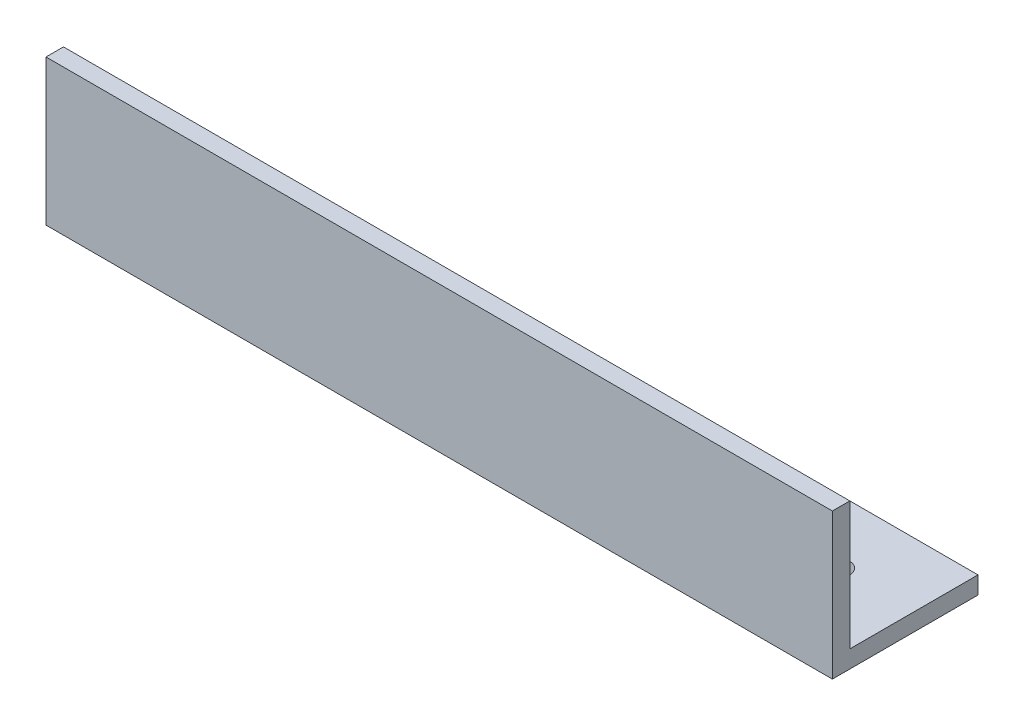
ISO-10303-21;
HEADER;
FILE_DESCRIPTION(('STEP AP214'),'2;1');
FILE_NAME('part.step','',(''),(''),'','','');
FILE_SCHEMA(('AUTOMOTIVE_DESIGN { 1 0 10303 214 1 1 1 1 }'));
ENDSEC;
DATA;
#1=APPLICATION_CONTEXT('core data for automotive mechanical design processes');
#2=APPLICATION_PROTOCOL_DEFINITION('international standard','automotive_design',2000,#1);
#3=PRODUCT_CONTEXT('',#1,'mechanical');
#4=PRODUCT('Part','Part','',(#3));
#5=PRODUCT_RELATED_PRODUCT_CATEGORY('part','',(#4));
#6=PRODUCT_DEFINITION_FORMATION('','',#4);
#7=PRODUCT_DEFINITION_CONTEXT('part definition',#1,'design');
#8=PRODUCT_DEFINITION('design','',#6,#7);
#9=PRODUCT_DEFINITION_SHAPE('','',#8);
#10=(LENGTH_UNIT() NAMED_UNIT(*) SI_UNIT(.MILLI.,.METRE.));
#11=(NAMED_UNIT(*) PLANE_ANGLE_UNIT() SI_UNIT($,.RADIAN.));
#12=(NAMED_UNIT(*) SI_UNIT($,.STERADIAN.) SOLID_ANGLE_UNIT());
#13=UNCERTAINTY_MEASURE_WITH_UNIT(LENGTH_MEASURE(1.E-05),#10,'distance_accuracy_value','');
#14=(GEOMETRIC_REPRESENTATION_CONTEXT(3) GLOBAL_UNCERTAINTY_ASSIGNED_CONTEXT((#13)) GLOBAL_UNIT_ASSIGNED_CONTEXT((#10,
#11,#12)) REPRESENTATION_CONTEXT('',''));
#15=CARTESIAN_POINT('',(0.,0.,0.));
#16=DIRECTION('',(0.,0.,1.));
#17=DIRECTION('',(1.,0.,0.));
#18=AXIS2_PLACEMENT_3D('',#15,#16,#17);
#19=CARTESIAN_POINT('',(270.,0.,0.));
#20=DIRECTION('',(0.,1.,0.));
#21=DIRECTION('',(0.,0.,1.));
#22=AXIS2_PLACEMENT_3D('',#19,#20,#21);
#23=PLANE('',#22);
#24=CARTESIAN_POINT('',(244.,0.,-28.));
#25=DIRECTION('',(0.,-1.,0.));
#26=DIRECTION('',(0.,0.,1.));
#27=AXIS2_PLACEMENT_3D('',#24,#25,#26);
#28=CIRCLE('',#27,3.99999999999999);
#29=CARTESIAN_POINT('',(244.,0.,-24.));
#30=VERTEX_POINT('',#29);
#31=EDGE_CURVE('E143',#30,#30,#28,.T.);
#32=ORIENTED_EDGE('',*,*,#31,.F.);
#33=EDGE_LOOP('',(#32));
#34=FACE_BOUND('',#33,.T.);
#35=CARTESIAN_POINT('',(26.,0.,-28.));
#36=DIRECTION('',(0.,-1.,0.));
#37=DIRECTION('',(0.,0.,-1.));
#38=AXIS2_PLACEMENT_3D('',#35,#36,#37);
#39=CIRCLE('',#38,4.);
#40=CARTESIAN_POINT('',(26.,0.,-32.));
#41=VERTEX_POINT('',#40);
#42=EDGE_CURVE('E135',#41,#41,#39,.T.);
#43=ORIENTED_EDGE('',*,*,#42,.F.);
#44=EDGE_LOOP('',(#43));
#45=FACE_BOUND('',#44,.T.);
#46=DIRECTION('',(0.,0.,-1.));
#47=VECTOR('',#46,1.);
#48=CARTESIAN_POINT('',(0.,0.,0.));
#49=LINE('',#48,#47);
#50=CARTESIAN_POINT('',(0.,0.,0.));
#51=VERTEX_POINT('',#50);
#52=CARTESIAN_POINT('',(0.,0.,-50.));
#53=VERTEX_POINT('',#52);
#54=EDGE_CURVE('E117',#51,#53,#49,.T.);
#55=ORIENTED_EDGE('',*,*,#54,.T.);
#56=DIRECTION('',(-1.,0.,0.));
#57=VECTOR('',#56,1.);
#58=CARTESIAN_POINT('',(270.,0.,-50.));
#59=LINE('',#58,#57);
#60=CARTESIAN_POINT('',(270.,0.,-50.));
#61=VERTEX_POINT('',#60);
#62=EDGE_CURVE('E11',#61,#53,#59,.T.);
#63=ORIENTED_EDGE('',*,*,#62,.F.);
#64=DIRECTION('',(0.,0.,-1.));
#65=VECTOR('',#64,1.);
#66=CARTESIAN_POINT('',(270.,0.,0.));
#67=LINE('',#66,#65);
#68=CARTESIAN_POINT('',(270.,0.,0.));
#69=VERTEX_POINT('',#68);
#70=EDGE_CURVE('E82',#69,#61,#67,.T.);
#71=ORIENTED_EDGE('',*,*,#70,.F.);
#72=DIRECTION('',(-1.,0.,0.));
#73=VECTOR('',#72,1.);
#74=CARTESIAN_POINT('',(270.,0.,0.));
#75=LINE('',#74,#73);
#76=EDGE_CURVE('E113',#69,#51,#75,.T.);
#77=ORIENTED_EDGE('',*,*,#76,.T.);
#78=EDGE_LOOP('',(#55,#63,#71,#77));
#79=FACE_BOUND('',#78,.T.);
#80=ADVANCED_FACE('F34',(#34,#45,#79),#23,.F.);
#81=CARTESIAN_POINT('',(270.,6.,-50.));
#82=DIRECTION('',(0.,0.,-1.));
#83=DIRECTION('',(-1.,0.,0.));
#84=AXIS2_PLACEMENT_3D('',#81,#82,#83);
#85=PLANE('',#84);
#86=DIRECTION('',(0.,-1.,0.));
#87=VECTOR('',#86,1.);
#88=CARTESIAN_POINT('',(0.,6.,-50.));
#89=LINE('',#88,#87);
#90=CARTESIAN_POINT('',(0.,6.,-50.));
#91=VERTEX_POINT('',#90);
#92=EDGE_CURVE('E120',#91,#53,#89,.T.);
#93=ORIENTED_EDGE('',*,*,#92,.F.);
#94=DIRECTION('',(-1.,0.,0.));
#95=VECTOR('',#94,1.);
#96=CARTESIAN_POINT('',(270.,6.,-50.));
#97=LINE('',#96,#95);
#98=CARTESIAN_POINT('',(270.,6.,-50.));
#99=VERTEX_POINT('',#98);
#100=EDGE_CURVE('E43',#99,#91,#97,.T.);
#101=ORIENTED_EDGE('',*,*,#100,.F.);
#102=DIRECTION('',(0.,-1.,0.));
#103=VECTOR('',#102,1.);
#104=CARTESIAN_POINT('',(270.,6.,-50.));
#105=LINE('',#104,#103);
#106=EDGE_CURVE('E147',#99,#61,#105,.T.);
#107=ORIENTED_EDGE('',*,*,#106,.T.);
#108=ORIENTED_EDGE('',*,*,#62,.T.);
#109=EDGE_LOOP('',(#93,#101,#107,#108));
#110=FACE_BOUND('',#109,.T.);
#111=ADVANCED_FACE('F168',(#110),#85,.T.);
#112=CARTESIAN_POINT('',(270.,6.,0.));
#113=DIRECTION('',(0.,1.,0.));
#114=DIRECTION('',(0.,0.,1.));
#115=AXIS2_PLACEMENT_3D('',#112,#113,#114);
#116=PLANE('',#115);
#117=CARTESIAN_POINT('',(244.,6.,-28.));
#118=DIRECTION('',(0.,1.,0.));
#119=DIRECTION('',(0.,0.,1.));
#120=AXIS2_PLACEMENT_3D('',#117,#118,#119);
#121=CIRCLE('',#120,3.99999999999999);
#122=CARTESIAN_POINT('',(244.,6.,-24.));
#123=VERTEX_POINT('',#122);
#124=EDGE_CURVE('E37',#123,#123,#121,.T.);
#125=ORIENTED_EDGE('',*,*,#124,.F.);
#126=EDGE_LOOP('',(#125));
#127=FACE_BOUND('',#126,.T.);
#128=CARTESIAN_POINT('',(26.,6.,-28.));
#129=DIRECTION('',(0.,1.,0.));
#130=DIRECTION('',(0.,0.,1.));
#131=AXIS2_PLACEMENT_3D('',#128,#129,#130);
#132=CIRCLE('',#131,4.);
#133=CARTESIAN_POINT('',(26.,6.,-24.));
#134=VERTEX_POINT('',#133);
#135=EDGE_CURVE('E121',#134,#134,#132,.T.);
#136=ORIENTED_EDGE('',*,*,#135,.F.);
#137=EDGE_LOOP('',(#136));
#138=FACE_BOUND('',#137,.T.);
#139=DIRECTION('',(0.,0.,-1.));
#140=VECTOR('',#139,1.);
#141=CARTESIAN_POINT('',(0.,6.,0.));
#142=LINE('',#141,#140);
#143=CARTESIAN_POINT('',(0.,6.,-6.));
#144=VERTEX_POINT('',#143);
#145=EDGE_CURVE('E124',#144,#91,#142,.T.);
#146=ORIENTED_EDGE('',*,*,#145,.F.);
#147=DIRECTION('',(-1.,0.,0.));
#148=VECTOR('',#147,1.);
#149=CARTESIAN_POINT('',(270.,6.,-6.));
#150=LINE('',#149,#148);
#151=CARTESIAN_POINT('',(270.,6.,-6.));
#152=VERTEX_POINT('',#151);
#153=EDGE_CURVE('E103',#152,#144,#150,.T.);
#154=ORIENTED_EDGE('',*,*,#153,.F.);
#155=DIRECTION('',(0.,0.,-1.));
#156=VECTOR('',#155,1.);
#157=CARTESIAN_POINT('',(270.,6.,0.));
#158=LINE('',#157,#156);
#159=EDGE_CURVE('E109',#152,#99,#158,.T.);
#160=ORIENTED_EDGE('',*,*,#159,.T.);
#161=ORIENTED_EDGE('',*,*,#100,.T.);
#162=EDGE_LOOP('',(#146,#154,#160,#161));
#163=FACE_BOUND('',#162,.T.);
#164=ADVANCED_FACE('F151',(#127,#138,#163),#116,.T.);
#165=CARTESIAN_POINT('',(270.,50.,-6.));
#166=DIRECTION('',(0.,0.,-1.));
#167=DIRECTION('',(-1.,0.,0.));
#168=AXIS2_PLACEMENT_3D('',#165,#166,#167);
#169=PLANE('',#168);
#170=DIRECTION('',(0.,1.,0.));
#171=VECTOR('',#170,1.);
#172=CARTESIAN_POINT('',(0.,50.,-6.));
#173=LINE('',#172,#171);
#174=CARTESIAN_POINT('',(0.,50.,-6.));
#175=VERTEX_POINT('',#174);
#176=EDGE_CURVE('E98',#175,#144,#173,.F.);
#177=ORIENTED_EDGE('',*,*,#176,.F.);
#178=DIRECTION('',(-1.,0.,0.));
#179=VECTOR('',#178,1.);
#180=CARTESIAN_POINT('',(270.,50.,-6.));
#181=LINE('',#180,#179);
#182=CARTESIAN_POINT('',(270.,50.,-6.));
#183=VERTEX_POINT('',#182);
#184=EDGE_CURVE('E93',#183,#175,#181,.T.);
#185=ORIENTED_EDGE('',*,*,#184,.F.);
#186=DIRECTION('',(0.,1.,0.));
#187=VECTOR('',#186,1.);
#188=CARTESIAN_POINT('',(270.,50.,-6.));
#189=LINE('',#188,#187);
#190=EDGE_CURVE('E96',#183,#152,#189,.F.);
#191=ORIENTED_EDGE('',*,*,#190,.T.);
#192=ORIENTED_EDGE('',*,*,#153,.T.);
#193=EDGE_LOOP('',(#177,#185,#191,#192));
#194=FACE_BOUND('',#193,.T.);
#195=ADVANCED_FACE('F95',(#194),#169,.T.);
#196=CARTESIAN_POINT('',(270.,50.,0.));
#197=DIRECTION('',(0.,1.,0.));
#198=DIRECTION('',(0.,0.,1.));
#199=AXIS2_PLACEMENT_3D('',#196,#197,#198);
#200=PLANE('',#199);
#201=DIRECTION('',(0.,0.,-1.));
#202=VECTOR('',#201,1.);
#203=CARTESIAN_POINT('',(0.,50.,0.));
#204=LINE('',#203,#202);
#205=CARTESIAN_POINT('',(0.,50.,0.));
#206=VERTEX_POINT('',#205);
#207=EDGE_CURVE('E128',#206,#175,#204,.T.);
#208=ORIENTED_EDGE('',*,*,#207,.F.);
#209=DIRECTION('',(-1.,0.,0.));
#210=VECTOR('',#209,1.);
#211=CARTESIAN_POINT('',(270.,50.,0.));
#212=LINE('',#211,#210);
#213=CARTESIAN_POINT('',(270.,50.,0.));
#214=VERTEX_POINT('',#213);
#215=EDGE_CURVE('E73',#214,#206,#212,.T.);
#216=ORIENTED_EDGE('',*,*,#215,.F.);
#217=DIRECTION('',(0.,0.,-1.));
#218=VECTOR('',#217,1.);
#219=CARTESIAN_POINT('',(270.,50.,0.));
#220=LINE('',#219,#218);
#221=EDGE_CURVE('E107',#214,#183,#220,.T.);
#222=ORIENTED_EDGE('',*,*,#221,.T.);
#223=ORIENTED_EDGE('',*,*,#184,.T.);
#224=EDGE_LOOP('',(#208,#216,#222,#223));
#225=FACE_BOUND('',#224,.T.);
#226=ADVANCED_FACE('F111',(#225),#200,.T.);
#227=CARTESIAN_POINT('',(270.,50.,0.));
#228=DIRECTION('',(0.,0.,-1.));
#229=DIRECTION('',(-1.,0.,0.));
#230=AXIS2_PLACEMENT_3D('',#227,#228,#229);
#231=PLANE('',#230);
#232=DIRECTION('',(0.,-1.,0.));
#233=VECTOR('',#232,1.);
#234=CARTESIAN_POINT('',(0.,50.,0.));
#235=LINE('',#234,#233);
#236=EDGE_CURVE('E76',#206,#51,#235,.T.);
#237=ORIENTED_EDGE('',*,*,#236,.T.);
#238=ORIENTED_EDGE('',*,*,#76,.F.);
#239=DIRECTION('',(0.,-1.,0.));
#240=VECTOR('',#239,1.);
#241=CARTESIAN_POINT('',(270.,50.,0.));
#242=LINE('',#241,#240);
#243=EDGE_CURVE('E52',#214,#69,#242,.T.);
#244=ORIENTED_EDGE('',*,*,#243,.F.);
#245=ORIENTED_EDGE('',*,*,#215,.T.);
#246=EDGE_LOOP('',(#237,#238,#244,#245));
#247=FACE_BOUND('',#246,.T.);
#248=ADVANCED_FACE('F157',(#247),#231,.F.);
#249=CARTESIAN_POINT('',(270.,0.,0.));
#250=DIRECTION('',(-1.,0.,0.));
#251=DIRECTION('',(0.,0.,1.));
#252=AXIS2_PLACEMENT_3D('',#249,#250,#251);
#253=PLANE('',#252);
#254=ORIENTED_EDGE('',*,*,#70,.T.);
#255=ORIENTED_EDGE('',*,*,#106,.F.);
#256=ORIENTED_EDGE('',*,*,#159,.F.);
#257=ORIENTED_EDGE('',*,*,#190,.F.);
#258=ORIENTED_EDGE('',*,*,#221,.F.);
#259=ORIENTED_EDGE('',*,*,#243,.T.);
#260=EDGE_LOOP('',(#254,#255,#256,#257,#258,#259));
#261=FACE_BOUND('',#260,.T.);
#262=ADVANCED_FACE('F106',(#261),#253,.F.);
#263=CARTESIAN_POINT('',(0.,0.,0.));
#264=DIRECTION('',(-1.,0.,0.));
#265=DIRECTION('',(0.,0.,1.));
#266=AXIS2_PLACEMENT_3D('',#263,#264,#265);
#267=PLANE('',#266);
#268=ORIENTED_EDGE('',*,*,#54,.F.);
#269=ORIENTED_EDGE('',*,*,#236,.F.);
#270=ORIENTED_EDGE('',*,*,#207,.T.);
#271=ORIENTED_EDGE('',*,*,#176,.T.);
#272=ORIENTED_EDGE('',*,*,#145,.T.);
#273=ORIENTED_EDGE('',*,*,#92,.T.);
#274=EDGE_LOOP('',(#268,#269,#270,#271,#272,#273));
#275=FACE_BOUND('',#274,.T.);
#276=ADVANCED_FACE('F155',(#275),#267,.T.);
#277=CARTESIAN_POINT('',(26.,50.,-28.));
#278=DIRECTION('',(0.,-1.,0.));
#279=DIRECTION('',(0.,0.,-1.));
#280=AXIS2_PLACEMENT_3D('',#277,#278,#279);
#281=CYLINDRICAL_SURFACE('',#280,4.);
#282=ORIENTED_EDGE('',*,*,#135,.T.);
#283=EDGE_LOOP('',(#282));
#284=FACE_BOUND('',#283,.T.);
#285=ORIENTED_EDGE('',*,*,#42,.T.);
#286=EDGE_LOOP('',(#285));
#287=FACE_BOUND('',#286,.T.);
#288=ADVANCED_FACE('F180',(#284,#287),#281,.F.);
#289=CARTESIAN_POINT('',(244.,50.,-28.));
#290=DIRECTION('',(0.,-1.,0.));
#291=DIRECTION('',(0.,0.,-1.));
#292=AXIS2_PLACEMENT_3D('',#289,#290,#291);
#293=CYLINDRICAL_SURFACE('',#292,3.99999999999999);
#294=ORIENTED_EDGE('',*,*,#124,.T.);
#295=EDGE_LOOP('',(#294));
#296=FACE_BOUND('',#295,.T.);
#297=ORIENTED_EDGE('',*,*,#31,.T.);
#298=EDGE_LOOP('',(#297));
#299=FACE_BOUND('',#298,.T.);
#300=ADVANCED_FACE('F178',(#296,#299),#293,.F.);
#301=CLOSED_SHELL('',(#80,#111,#164,#195,#226,#248,#262,#276,#288,#300));
#302=MANIFOLD_SOLID_BREP('B2',#301);
#303=ADVANCED_BREP_SHAPE_REPRESENTATION('',(#18,#302),#14);
#304=SHAPE_DEFINITION_REPRESENTATION(#9,#303);
ENDSEC;
END-ISO-10303-21;
